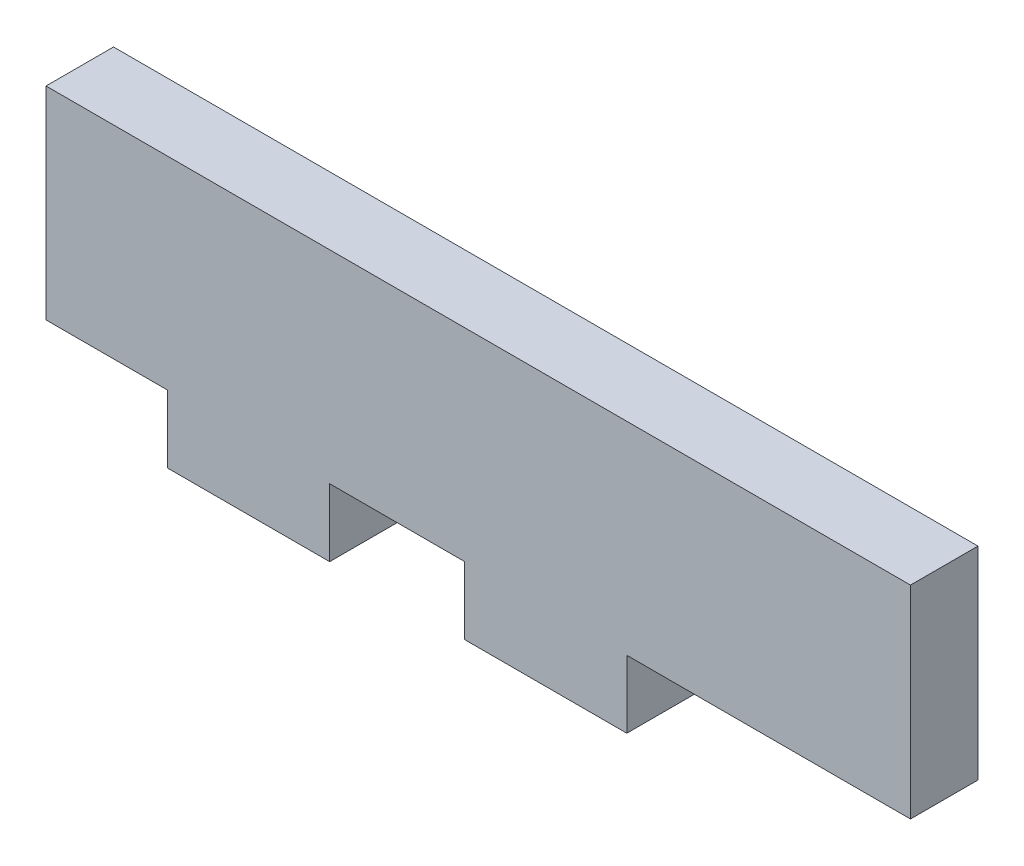
ISO-10303-21;
HEADER;
FILE_DESCRIPTION(('STEP AP214'),'2;1');
FILE_NAME('part.step','',(''),(''),'','','');
FILE_SCHEMA(('AUTOMOTIVE_DESIGN { 1 0 10303 214 1 1 1 1 }'));
ENDSEC;
DATA;
#1=APPLICATION_CONTEXT('core data for automotive mechanical design processes');
#2=APPLICATION_PROTOCOL_DEFINITION('international standard','automotive_design',2000,#1);
#3=PRODUCT_CONTEXT('',#1,'mechanical');
#4=PRODUCT('Part','Part','',(#3));
#5=PRODUCT_RELATED_PRODUCT_CATEGORY('part','',(#4));
#6=PRODUCT_DEFINITION_FORMATION('','',#4);
#7=PRODUCT_DEFINITION_CONTEXT('part definition',#1,'design');
#8=PRODUCT_DEFINITION('design','',#6,#7);
#9=PRODUCT_DEFINITION_SHAPE('','',#8);
#10=(LENGTH_UNIT() NAMED_UNIT(*) SI_UNIT(.MILLI.,.METRE.));
#11=(NAMED_UNIT(*) PLANE_ANGLE_UNIT() SI_UNIT($,.RADIAN.));
#12=(NAMED_UNIT(*) SI_UNIT($,.STERADIAN.) SOLID_ANGLE_UNIT());
#13=UNCERTAINTY_MEASURE_WITH_UNIT(LENGTH_MEASURE(1.E-05),#10,'distance_accuracy_value','');
#14=(GEOMETRIC_REPRESENTATION_CONTEXT(3) GLOBAL_UNCERTAINTY_ASSIGNED_CONTEXT((#13)) GLOBAL_UNIT_ASSIGNED_CONTEXT((#10,
#11,#12)) REPRESENTATION_CONTEXT('',''));
#15=CARTESIAN_POINT('',(0.,0.,0.));
#16=DIRECTION('',(0.,0.,1.));
#17=DIRECTION('',(1.,0.,0.));
#18=AXIS2_PLACEMENT_3D('',#15,#16,#17);
#19=CARTESIAN_POINT('',(26.67,0.,6.35));
#20=DIRECTION('',(1.,0.,0.));
#21=DIRECTION('',(0.,0.,-1.));
#22=AXIS2_PLACEMENT_3D('',#19,#20,#21);
#23=PLANE('',#22);
#24=DIRECTION('',(0.,-1.,0.));
#25=VECTOR('',#24,1.);
#26=CARTESIAN_POINT('',(26.67,0.,0.));
#27=LINE('',#26,#25);
#28=CARTESIAN_POINT('',(26.67,0.,0.));
#29=VERTEX_POINT('',#28);
#30=CARTESIAN_POINT('',(26.67,-6.35,0.));
#31=VERTEX_POINT('',#30);
#32=EDGE_CURVE('E166',#29,#31,#27,.T.);
#33=ORIENTED_EDGE('',*,*,#32,.F.);
#34=DIRECTION('',(0.,0.,-1.));
#35=VECTOR('',#34,1.);
#36=CARTESIAN_POINT('',(26.67,0.,6.35));
#37=LINE('',#36,#35);
#38=CARTESIAN_POINT('',(26.67,0.,6.35));
#39=VERTEX_POINT('',#38);
#40=EDGE_CURVE('E11',#39,#29,#37,.T.);
#41=ORIENTED_EDGE('',*,*,#40,.F.);
#42=DIRECTION('',(0.,-1.,0.));
#43=VECTOR('',#42,1.);
#44=CARTESIAN_POINT('',(26.67,0.,6.35));
#45=LINE('',#44,#43);
#46=CARTESIAN_POINT('',(26.67,-6.35,6.35));
#47=VERTEX_POINT('',#46);
#48=EDGE_CURVE('E202',#39,#47,#45,.T.);
#49=ORIENTED_EDGE('',*,*,#48,.T.);
#50=DIRECTION('',(0.,0.,-1.));
#51=VECTOR('',#50,1.);
#52=CARTESIAN_POINT('',(26.67,-6.35,6.35));
#53=LINE('',#52,#51);
#54=EDGE_CURVE('E105',#47,#31,#53,.T.);
#55=ORIENTED_EDGE('',*,*,#54,.T.);
#56=EDGE_LOOP('',(#33,#41,#49,#55));
#57=FACE_BOUND('',#56,.T.);
#58=ADVANCED_FACE('F41',(#57),#23,.T.);
#59=CARTESIAN_POINT('',(0.,0.,6.35));
#60=DIRECTION('',(0.,1.,0.));
#61=DIRECTION('',(0.,0.,1.));
#62=AXIS2_PLACEMENT_3D('',#59,#60,#61);
#63=PLANE('',#62);
#64=DIRECTION('',(1.,0.,0.));
#65=VECTOR('',#64,1.);
#66=CARTESIAN_POINT('',(0.,0.,0.));
#67=LINE('',#66,#65);
#68=CARTESIAN_POINT('',(39.37,0.,0.));
#69=VERTEX_POINT('',#68);
#70=EDGE_CURVE('E170',#29,#69,#67,.T.);
#71=ORIENTED_EDGE('',*,*,#70,.T.);
#72=DIRECTION('',(0.,0.,-1.));
#73=VECTOR('',#72,1.);
#74=CARTESIAN_POINT('',(39.37,0.,6.35));
#75=LINE('',#74,#73);
#76=CARTESIAN_POINT('',(39.37,0.,6.35));
#77=VERTEX_POINT('',#76);
#78=EDGE_CURVE('E50',#77,#69,#75,.T.);
#79=ORIENTED_EDGE('',*,*,#78,.F.);
#80=DIRECTION('',(1.,0.,0.));
#81=VECTOR('',#80,1.);
#82=CARTESIAN_POINT('',(0.,0.,6.35));
#83=LINE('',#82,#81);
#84=EDGE_CURVE('E149',#39,#77,#83,.T.);
#85=ORIENTED_EDGE('',*,*,#84,.F.);
#86=ORIENTED_EDGE('',*,*,#40,.T.);
#87=EDGE_LOOP('',(#71,#79,#85,#86));
#88=FACE_BOUND('',#87,.T.);
#89=ADVANCED_FACE('F288',(#88),#63,.F.);
#90=CARTESIAN_POINT('',(39.37,0.,6.35));
#91=DIRECTION('',(1.,0.,0.));
#92=DIRECTION('',(0.,0.,-1.));
#93=AXIS2_PLACEMENT_3D('',#90,#91,#92);
#94=PLANE('',#93);
#95=DIRECTION('',(0.,-1.,0.));
#96=VECTOR('',#95,1.);
#97=CARTESIAN_POINT('',(39.37,0.,0.));
#98=LINE('',#97,#96);
#99=CARTESIAN_POINT('',(39.37,-6.35,0.));
#100=VERTEX_POINT('',#99);
#101=EDGE_CURVE('E173',#69,#100,#98,.T.);
#102=ORIENTED_EDGE('',*,*,#101,.T.);
#103=DIRECTION('',(0.,0.,-1.));
#104=VECTOR('',#103,1.);
#105=CARTESIAN_POINT('',(39.37,-6.35,6.35));
#106=LINE('',#105,#104);
#107=CARTESIAN_POINT('',(39.37,-6.35,6.35));
#108=VERTEX_POINT('',#107);
#109=EDGE_CURVE('E225',#108,#100,#106,.T.);
#110=ORIENTED_EDGE('',*,*,#109,.F.);
#111=DIRECTION('',(0.,-1.,0.));
#112=VECTOR('',#111,1.);
#113=CARTESIAN_POINT('',(39.37,0.,6.35));
#114=LINE('',#113,#112);
#115=EDGE_CURVE('E236',#77,#108,#114,.T.);
#116=ORIENTED_EDGE('',*,*,#115,.F.);
#117=ORIENTED_EDGE('',*,*,#78,.T.);
#118=EDGE_LOOP('',(#102,#110,#116,#117));
#119=FACE_BOUND('',#118,.T.);
#120=ADVANCED_FACE('F234',(#119),#94,.F.);
#121=CARTESIAN_POINT('',(0.,-6.35,6.35));
#122=DIRECTION('',(0.,1.,0.));
#123=DIRECTION('',(0.,0.,1.));
#124=AXIS2_PLACEMENT_3D('',#121,#122,#123);
#125=PLANE('',#124);
#126=DIRECTION('',(1.,0.,0.));
#127=VECTOR('',#126,1.);
#128=CARTESIAN_POINT('',(0.,-6.35,0.));
#129=LINE('',#128,#127);
#130=CARTESIAN_POINT('',(54.61,-6.35,0.));
#131=VERTEX_POINT('',#130);
#132=EDGE_CURVE('E177',#100,#131,#129,.T.);
#133=ORIENTED_EDGE('',*,*,#132,.T.);
#134=DIRECTION('',(0.,0.,-1.));
#135=VECTOR('',#134,1.);
#136=CARTESIAN_POINT('',(54.61,-6.35,6.35));
#137=LINE('',#136,#135);
#138=CARTESIAN_POINT('',(54.61,-6.35,6.35));
#139=VERTEX_POINT('',#138);
#140=EDGE_CURVE('E222',#139,#131,#137,.T.);
#141=ORIENTED_EDGE('',*,*,#140,.F.);
#142=DIRECTION('',(1.,0.,0.));
#143=VECTOR('',#142,1.);
#144=CARTESIAN_POINT('',(0.,-6.35,6.35));
#145=LINE('',#144,#143);
#146=EDGE_CURVE('E249',#108,#139,#145,.T.);
#147=ORIENTED_EDGE('',*,*,#146,.F.);
#148=ORIENTED_EDGE('',*,*,#109,.T.);
#149=EDGE_LOOP('',(#133,#141,#147,#148));
#150=FACE_BOUND('',#149,.T.);
#151=ADVANCED_FACE('F246',(#150),#125,.F.);
#152=CARTESIAN_POINT('',(54.61,0.,6.35));
#153=DIRECTION('',(1.,0.,0.));
#154=DIRECTION('',(0.,0.,-1.));
#155=AXIS2_PLACEMENT_3D('',#152,#153,#154);
#156=PLANE('',#155);
#157=DIRECTION('',(0.,-1.,0.));
#158=VECTOR('',#157,1.);
#159=CARTESIAN_POINT('',(54.61,0.,0.));
#160=LINE('',#159,#158);
#161=CARTESIAN_POINT('',(54.61,0.,0.));
#162=VERTEX_POINT('',#161);
#163=EDGE_CURVE('E181',#162,#131,#160,.T.);
#164=ORIENTED_EDGE('',*,*,#163,.F.);
#165=DIRECTION('',(0.,0.,-1.));
#166=VECTOR('',#165,1.);
#167=CARTESIAN_POINT('',(54.61,0.,6.35));
#168=LINE('',#167,#166);
#169=CARTESIAN_POINT('',(54.61,0.,6.35));
#170=VERTEX_POINT('',#169);
#171=EDGE_CURVE('E219',#170,#162,#168,.T.);
#172=ORIENTED_EDGE('',*,*,#171,.F.);
#173=DIRECTION('',(0.,-1.,0.));
#174=VECTOR('',#173,1.);
#175=CARTESIAN_POINT('',(54.61,0.,6.35));
#176=LINE('',#175,#174);
#177=EDGE_CURVE('E252',#170,#139,#176,.T.);
#178=ORIENTED_EDGE('',*,*,#177,.T.);
#179=ORIENTED_EDGE('',*,*,#140,.T.);
#180=EDGE_LOOP('',(#164,#172,#178,#179));
#181=FACE_BOUND('',#180,.T.);
#182=ADVANCED_FACE('F299',(#181),#156,.T.);
#183=CARTESIAN_POINT('',(81.28,0.,0.));
#184=VERTEX_POINT('',#183);
#185=EDGE_CURVE('E174',#162,#184,#67,.T.);
#186=ORIENTED_EDGE('',*,*,#185,.T.);
#187=DIRECTION('',(0.,0.,-1.));
#188=VECTOR('',#187,1.);
#189=CARTESIAN_POINT('',(81.28,0.,6.35));
#190=LINE('',#189,#188);
#191=CARTESIAN_POINT('',(81.28,0.,6.35));
#192=VERTEX_POINT('',#191);
#193=EDGE_CURVE('E215',#192,#184,#190,.T.);
#194=ORIENTED_EDGE('',*,*,#193,.F.);
#195=EDGE_CURVE('E148',#170,#192,#83,.T.);
#196=ORIENTED_EDGE('',*,*,#195,.F.);
#197=ORIENTED_EDGE('',*,*,#171,.T.);
#198=EDGE_LOOP('',(#186,#194,#196,#197));
#199=FACE_BOUND('',#198,.T.);
#200=ADVANCED_FACE('F275',(#199),#63,.F.);
#201=CARTESIAN_POINT('',(81.28,0.,6.35));
#202=DIRECTION('',(-1.,0.,0.));
#203=DIRECTION('',(0.,0.,1.));
#204=AXIS2_PLACEMENT_3D('',#201,#202,#203);
#205=PLANE('',#204);
#206=DIRECTION('',(0.,1.,0.));
#207=VECTOR('',#206,1.);
#208=CARTESIAN_POINT('',(81.28,0.,0.));
#209=LINE('',#208,#207);
#210=CARTESIAN_POINT('',(81.28,19.05,0.));
#211=VERTEX_POINT('',#210);
#212=EDGE_CURVE('E185',#184,#211,#209,.T.);
#213=ORIENTED_EDGE('',*,*,#212,.T.);
#214=DIRECTION('',(0.,0.,-1.));
#215=VECTOR('',#214,1.);
#216=CARTESIAN_POINT('',(81.28,19.05,6.35));
#217=LINE('',#216,#215);
#218=CARTESIAN_POINT('',(81.28,19.05,6.35));
#219=VERTEX_POINT('',#218);
#220=EDGE_CURVE('E212',#219,#211,#217,.T.);
#221=ORIENTED_EDGE('',*,*,#220,.F.);
#222=DIRECTION('',(0.,1.,0.));
#223=VECTOR('',#222,1.);
#224=CARTESIAN_POINT('',(81.28,0.,6.35));
#225=LINE('',#224,#223);
#226=EDGE_CURVE('E259',#192,#219,#225,.T.);
#227=ORIENTED_EDGE('',*,*,#226,.F.);
#228=ORIENTED_EDGE('',*,*,#193,.T.);
#229=EDGE_LOOP('',(#213,#221,#227,#228));
#230=FACE_BOUND('',#229,.T.);
#231=ADVANCED_FACE('F280',(#230),#205,.F.);
#232=CARTESIAN_POINT('',(0.,19.05,6.35));
#233=DIRECTION('',(0.,1.,0.));
#234=DIRECTION('',(-1.,0.,0.));
#235=AXIS2_PLACEMENT_3D('',#232,#233,#234);
#236=PLANE('',#235);
#237=DIRECTION('',(1.,0.,0.));
#238=VECTOR('',#237,1.);
#239=CARTESIAN_POINT('',(0.,19.05,0.));
#240=LINE('',#239,#238);
#241=CARTESIAN_POINT('',(0.,19.05,0.));
#242=VERTEX_POINT('',#241);
#243=EDGE_CURVE('E189',#242,#211,#240,.T.);
#244=ORIENTED_EDGE('',*,*,#243,.F.);
#245=DIRECTION('',(0.,0.,-1.));
#246=VECTOR('',#245,1.);
#247=CARTESIAN_POINT('',(0.,19.05,6.35));
#248=LINE('',#247,#246);
#249=CARTESIAN_POINT('',(0.,19.05,6.35));
#250=VERTEX_POINT('',#249);
#251=EDGE_CURVE('E209',#250,#242,#248,.T.);
#252=ORIENTED_EDGE('',*,*,#251,.F.);
#253=DIRECTION('',(1.,0.,0.));
#254=VECTOR('',#253,1.);
#255=CARTESIAN_POINT('',(0.,19.05,6.35));
#256=LINE('',#255,#254);
#257=EDGE_CURVE('E261',#250,#219,#256,.T.);
#258=ORIENTED_EDGE('',*,*,#257,.T.);
#259=ORIENTED_EDGE('',*,*,#220,.T.);
#260=EDGE_LOOP('',(#244,#252,#258,#259));
#261=FACE_BOUND('',#260,.T.);
#262=ADVANCED_FACE('F282',(#261),#236,.T.);
#263=CARTESIAN_POINT('',(0.,0.,6.35));
#264=DIRECTION('',(-1.,0.,0.));
#265=DIRECTION('',(0.,0.,1.));
#266=AXIS2_PLACEMENT_3D('',#263,#264,#265);
#267=PLANE('',#266);
#268=DIRECTION('',(0.,1.,0.));
#269=VECTOR('',#268,1.);
#270=CARTESIAN_POINT('',(0.,0.,0.));
#271=LINE('',#270,#269);
#272=CARTESIAN_POINT('',(0.,0.,0.));
#273=VERTEX_POINT('',#272);
#274=EDGE_CURVE('E193',#273,#242,#271,.T.);
#275=ORIENTED_EDGE('',*,*,#274,.F.);
#276=DIRECTION('',(0.,0.,-1.));
#277=VECTOR('',#276,1.);
#278=CARTESIAN_POINT('',(0.,0.,6.35));
#279=LINE('',#278,#277);
#280=CARTESIAN_POINT('',(0.,0.,6.35));
#281=VERTEX_POINT('',#280);
#282=EDGE_CURVE('E155',#281,#273,#279,.T.);
#283=ORIENTED_EDGE('',*,*,#282,.F.);
#284=DIRECTION('',(0.,1.,0.));
#285=VECTOR('',#284,1.);
#286=CARTESIAN_POINT('',(0.,0.,6.35));
#287=LINE('',#286,#285);
#288=EDGE_CURVE('E144',#281,#250,#287,.T.);
#289=ORIENTED_EDGE('',*,*,#288,.T.);
#290=ORIENTED_EDGE('',*,*,#251,.T.);
#291=EDGE_LOOP('',(#275,#283,#289,#290));
#292=FACE_BOUND('',#291,.T.);
#293=ADVANCED_FACE('F268',(#292),#267,.T.);
#294=CARTESIAN_POINT('',(11.43,0.,0.));
#295=VERTEX_POINT('',#294);
#296=EDGE_CURVE('E153',#273,#295,#67,.T.);
#297=ORIENTED_EDGE('',*,*,#296,.T.);
#298=DIRECTION('',(0.,0.,-1.));
#299=VECTOR('',#298,1.);
#300=CARTESIAN_POINT('',(11.43,0.,6.35));
#301=LINE('',#300,#299);
#302=CARTESIAN_POINT('',(11.43,0.,6.35));
#303=VERTEX_POINT('',#302);
#304=EDGE_CURVE('E150',#303,#295,#301,.T.);
#305=ORIENTED_EDGE('',*,*,#304,.F.);
#306=EDGE_CURVE('E137',#281,#303,#83,.T.);
#307=ORIENTED_EDGE('',*,*,#306,.F.);
#308=ORIENTED_EDGE('',*,*,#282,.T.);
#309=EDGE_LOOP('',(#297,#305,#307,#308));
#310=FACE_BOUND('',#309,.T.);
#311=ADVANCED_FACE('F151',(#310),#63,.F.);
#312=CARTESIAN_POINT('',(11.43,0.,6.35));
#313=DIRECTION('',(1.,0.,0.));
#314=DIRECTION('',(0.,0.,-1.));
#315=AXIS2_PLACEMENT_3D('',#312,#313,#314);
#316=PLANE('',#315);
#317=DIRECTION('',(0.,-1.,0.));
#318=VECTOR('',#317,1.);
#319=CARTESIAN_POINT('',(11.43,0.,0.));
#320=LINE('',#319,#318);
#321=CARTESIAN_POINT('',(11.43,-6.35,0.));
#322=VERTEX_POINT('',#321);
#323=EDGE_CURVE('E98',#295,#322,#320,.T.);
#324=ORIENTED_EDGE('',*,*,#323,.T.);
#325=DIRECTION('',(0.,0.,-1.));
#326=VECTOR('',#325,1.);
#327=CARTESIAN_POINT('',(11.43,-6.35,6.35));
#328=LINE('',#327,#326);
#329=CARTESIAN_POINT('',(11.43,-6.35,6.35));
#330=VERTEX_POINT('',#329);
#331=EDGE_CURVE('E156',#330,#322,#328,.T.);
#332=ORIENTED_EDGE('',*,*,#331,.F.);
#333=DIRECTION('',(0.,-1.,0.));
#334=VECTOR('',#333,1.);
#335=CARTESIAN_POINT('',(11.43,0.,6.35));
#336=LINE('',#335,#334);
#337=EDGE_CURVE('E141',#303,#330,#336,.T.);
#338=ORIENTED_EDGE('',*,*,#337,.F.);
#339=ORIENTED_EDGE('',*,*,#304,.T.);
#340=EDGE_LOOP('',(#324,#332,#338,#339));
#341=FACE_BOUND('',#340,.T.);
#342=ADVANCED_FACE('F158',(#341),#316,.F.);
#343=CARTESIAN_POINT('',(0.,-6.35,6.35));
#344=DIRECTION('',(0.,1.,0.));
#345=DIRECTION('',(0.,0.,1.));
#346=AXIS2_PLACEMENT_3D('',#343,#344,#345);
#347=PLANE('',#346);
#348=DIRECTION('',(1.,0.,0.));
#349=VECTOR('',#348,1.);
#350=CARTESIAN_POINT('',(0.,-6.35,0.));
#351=LINE('',#350,#349);
#352=EDGE_CURVE('E199',#322,#31,#351,.T.);
#353=ORIENTED_EDGE('',*,*,#352,.T.);
#354=ORIENTED_EDGE('',*,*,#54,.F.);
#355=DIRECTION('',(1.,0.,0.));
#356=VECTOR('',#355,1.);
#357=CARTESIAN_POINT('',(0.,-6.35,6.35));
#358=LINE('',#357,#356);
#359=EDGE_CURVE('E58',#330,#47,#358,.T.);
#360=ORIENTED_EDGE('',*,*,#359,.F.);
#361=ORIENTED_EDGE('',*,*,#331,.T.);
#362=EDGE_LOOP('',(#353,#354,#360,#361));
#363=FACE_BOUND('',#362,.T.);
#364=ADVANCED_FACE('F305',(#363),#347,.F.);
#365=CARTESIAN_POINT('',(0.,0.,6.35));
#366=DIRECTION('',(0.,0.,1.));
#367=DIRECTION('',(1.,0.,0.));
#368=AXIS2_PLACEMENT_3D('',#365,#366,#367);
#369=PLANE('',#368);
#370=ORIENTED_EDGE('',*,*,#48,.F.);
#371=ORIENTED_EDGE('',*,*,#84,.T.);
#372=ORIENTED_EDGE('',*,*,#115,.T.);
#373=ORIENTED_EDGE('',*,*,#146,.T.);
#374=ORIENTED_EDGE('',*,*,#177,.F.);
#375=ORIENTED_EDGE('',*,*,#195,.T.);
#376=ORIENTED_EDGE('',*,*,#226,.T.);
#377=ORIENTED_EDGE('',*,*,#257,.F.);
#378=ORIENTED_EDGE('',*,*,#288,.F.);
#379=ORIENTED_EDGE('',*,*,#306,.T.);
#380=ORIENTED_EDGE('',*,*,#337,.T.);
#381=ORIENTED_EDGE('',*,*,#359,.T.);
#382=EDGE_LOOP('',(#370,#371,#372,#373,#374,#375,#376,#377,#378,#379,#380,#381));
#383=FACE_BOUND('',#382,.T.);
#384=ADVANCED_FACE('F139',(#383),#369,.T.);
#385=CARTESIAN_POINT('',(0.,0.,0.));
#386=DIRECTION('',(0.,0.,1.));
#387=DIRECTION('',(1.,0.,0.));
#388=AXIS2_PLACEMENT_3D('',#385,#386,#387);
#389=PLANE('',#388);
#390=ORIENTED_EDGE('',*,*,#32,.T.);
#391=ORIENTED_EDGE('',*,*,#352,.F.);
#392=ORIENTED_EDGE('',*,*,#323,.F.);
#393=ORIENTED_EDGE('',*,*,#296,.F.);
#394=ORIENTED_EDGE('',*,*,#274,.T.);
#395=ORIENTED_EDGE('',*,*,#243,.T.);
#396=ORIENTED_EDGE('',*,*,#212,.F.);
#397=ORIENTED_EDGE('',*,*,#185,.F.);
#398=ORIENTED_EDGE('',*,*,#163,.T.);
#399=ORIENTED_EDGE('',*,*,#132,.F.);
#400=ORIENTED_EDGE('',*,*,#101,.F.);
#401=ORIENTED_EDGE('',*,*,#70,.F.);
#402=EDGE_LOOP('',(#390,#391,#392,#393,#394,#395,#396,#397,#398,#399,#400,#401));
#403=FACE_BOUND('',#402,.T.);
#404=ADVANCED_FACE('F241',(#403),#389,.F.);
#405=CLOSED_SHELL('',(#58,#89,#120,#151,#182,#200,#231,#262,#293,#311,#342,#364,#384,#404));
#406=MANIFOLD_SOLID_BREP('B2',#405);
#407=ADVANCED_BREP_SHAPE_REPRESENTATION('',(#18,#406),#14);
#408=SHAPE_DEFINITION_REPRESENTATION(#9,#407);
ENDSEC;
END-ISO-10303-21;
